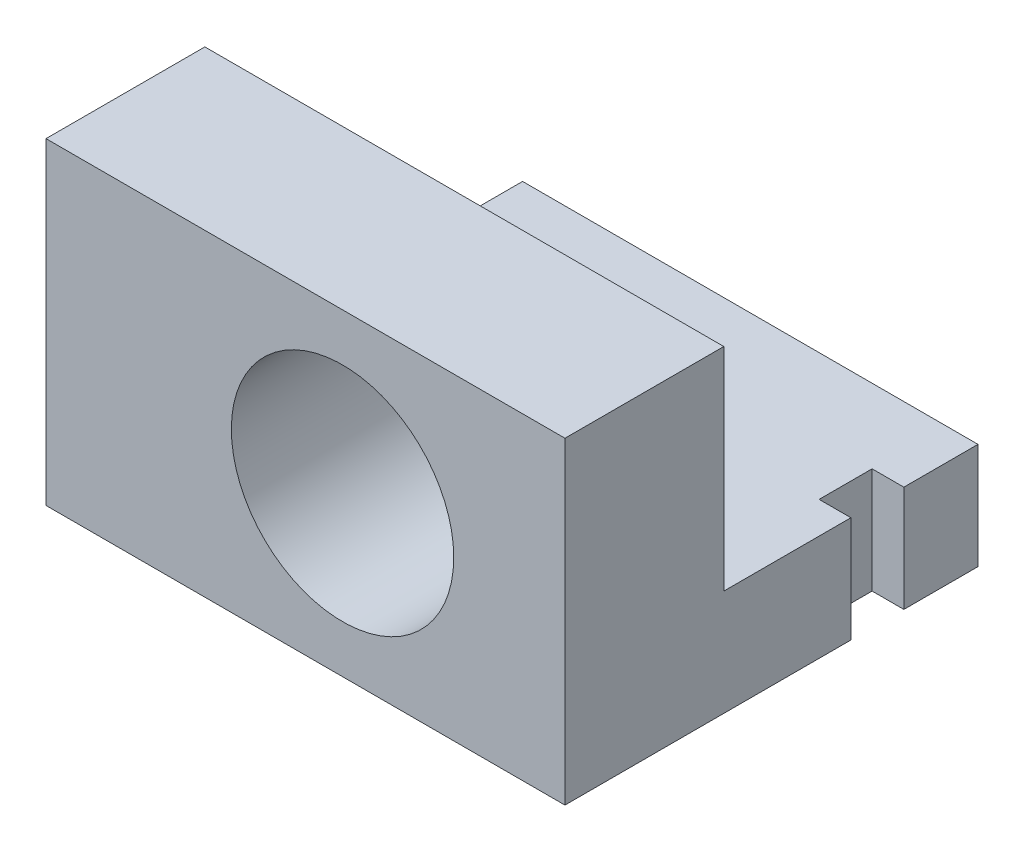
ISO-10303-21;
HEADER;
FILE_DESCRIPTION(('STEP AP214'),'2;1');
FILE_NAME('part.step','',(''),(''),'','','');
FILE_SCHEMA(('AUTOMOTIVE_DESIGN { 1 0 10303 214 1 1 1 1 }'));
ENDSEC;
DATA;
#1=APPLICATION_CONTEXT('core data for automotive mechanical design processes');
#2=APPLICATION_PROTOCOL_DEFINITION('international standard','automotive_design',2000,#1);
#3=PRODUCT_CONTEXT('',#1,'mechanical');
#4=PRODUCT('Part','Part','',(#3));
#5=PRODUCT_RELATED_PRODUCT_CATEGORY('part','',(#4));
#6=PRODUCT_DEFINITION_FORMATION('','',#4);
#7=PRODUCT_DEFINITION_CONTEXT('part definition',#1,'design');
#8=PRODUCT_DEFINITION('design','',#6,#7);
#9=PRODUCT_DEFINITION_SHAPE('','',#8);
#10=(LENGTH_UNIT() NAMED_UNIT(*) SI_UNIT(.MILLI.,.METRE.));
#11=(NAMED_UNIT(*) PLANE_ANGLE_UNIT() SI_UNIT($,.RADIAN.));
#12=(NAMED_UNIT(*) SI_UNIT($,.STERADIAN.) SOLID_ANGLE_UNIT());
#13=UNCERTAINTY_MEASURE_WITH_UNIT(LENGTH_MEASURE(1.E-05),#10,'distance_accuracy_value','');
#14=(GEOMETRIC_REPRESENTATION_CONTEXT(3) GLOBAL_UNCERTAINTY_ASSIGNED_CONTEXT((#13)) GLOBAL_UNIT_ASSIGNED_CONTEXT((#10,
#11,#12)) REPRESENTATION_CONTEXT('',''));
#15=CARTESIAN_POINT('',(0.,0.,0.));
#16=DIRECTION('',(0.,0.,1.));
#17=DIRECTION('',(1.,0.,0.));
#18=AXIS2_PLACEMENT_3D('',#15,#16,#17);
#19=CARTESIAN_POINT('',(-24.5,-15.,15.));
#20=DIRECTION('',(0.,1.,0.));
#21=DIRECTION('',(0.,0.,1.));
#22=AXIS2_PLACEMENT_3D('',#19,#20,#21);
#23=PLANE('',#22);
#24=DIRECTION('',(1.,0.,0.));
#25=VECTOR('',#24,1.);
#26=CARTESIAN_POINT('',(21.5,-15.,-17.));
#27=LINE('',#26,#25);
#28=CARTESIAN_POINT('',(21.5,-15.,-17.));
#29=VERTEX_POINT('',#28);
#30=CARTESIAN_POINT('',(24.5,-15.,-17.));
#31=VERTEX_POINT('',#30);
#32=EDGE_CURVE('E171',#29,#31,#27,.T.);
#33=ORIENTED_EDGE('',*,*,#32,.F.);
#34=DIRECTION('',(0.,0.,1.));
#35=VECTOR('',#34,1.);
#36=CARTESIAN_POINT('',(21.5,-15.,-17.));
#37=LINE('',#36,#35);
#38=CARTESIAN_POINT('',(21.5,-15.,-12.));
#39=VERTEX_POINT('',#38);
#40=EDGE_CURVE('E158',#29,#39,#37,.T.);
#41=ORIENTED_EDGE('',*,*,#40,.T.);
#42=DIRECTION('',(1.,0.,0.));
#43=VECTOR('',#42,1.);
#44=CARTESIAN_POINT('',(21.5,-15.,-12.));
#45=LINE('',#44,#43);
#46=CARTESIAN_POINT('',(24.5,-15.,-12.));
#47=VERTEX_POINT('',#46);
#48=EDGE_CURVE('E156',#39,#47,#45,.T.);
#49=ORIENTED_EDGE('',*,*,#48,.T.);
#50=DIRECTION('',(0.,0.,-1.));
#51=VECTOR('',#50,1.);
#52=CARTESIAN_POINT('',(24.5,-15.,15.));
#53=LINE('',#52,#51);
#54=CARTESIAN_POINT('',(24.5,-15.,15.));
#55=VERTEX_POINT('',#54);
#56=EDGE_CURVE('E254',#55,#47,#53,.T.);
#57=ORIENTED_EDGE('',*,*,#56,.F.);
#58=DIRECTION('',(1.,0.,0.));
#59=VECTOR('',#58,1.);
#60=CARTESIAN_POINT('',(-24.5,-15.,15.));
#61=LINE('',#60,#59);
#62=CARTESIAN_POINT('',(-24.5,-15.,15.));
#63=VERTEX_POINT('',#62);
#64=EDGE_CURVE('E233',#63,#55,#61,.T.);
#65=ORIENTED_EDGE('',*,*,#64,.F.);
#66=DIRECTION('',(0.,0.,-1.));
#67=VECTOR('',#66,1.);
#68=CARTESIAN_POINT('',(-24.5,-15.,15.));
#69=LINE('',#68,#67);
#70=CARTESIAN_POINT('',(-24.5,-15.,0.));
#71=VERTEX_POINT('',#70);
#72=EDGE_CURVE('E37',#63,#71,#69,.T.);
#73=ORIENTED_EDGE('',*,*,#72,.T.);
#74=DIRECTION('',(1.,0.,0.));
#75=VECTOR('',#74,1.);
#76=CARTESIAN_POINT('',(-24.5,-15.,0.));
#77=LINE('',#76,#75);
#78=CARTESIAN_POINT('',(-18.5,-15.,0.));
#79=VERTEX_POINT('',#78);
#80=EDGE_CURVE('E243',#71,#79,#77,.T.);
#81=ORIENTED_EDGE('',*,*,#80,.T.);
#82=DIRECTION('',(0.,0.,1.));
#83=VECTOR('',#82,1.);
#84=CARTESIAN_POINT('',(-18.5,-15.,-24.));
#85=LINE('',#84,#83);
#86=CARTESIAN_POINT('',(-18.5,-15.,-12.));
#87=VERTEX_POINT('',#86);
#88=EDGE_CURVE('E218',#87,#79,#85,.T.);
#89=ORIENTED_EDGE('',*,*,#88,.F.);
#90=DIRECTION('',(-1.,0.,0.));
#91=VECTOR('',#90,1.);
#92=CARTESIAN_POINT('',(-15.5,-15.,-12.));
#93=LINE('',#92,#91);
#94=CARTESIAN_POINT('',(-15.5,-15.,-12.));
#95=VERTEX_POINT('',#94);
#96=EDGE_CURVE('E195',#95,#87,#93,.T.);
#97=ORIENTED_EDGE('',*,*,#96,.F.);
#98=DIRECTION('',(0.,0.,1.));
#99=VECTOR('',#98,1.);
#100=CARTESIAN_POINT('',(-15.5,-15.,-17.));
#101=LINE('',#100,#99);
#102=CARTESIAN_POINT('',(-15.5,-15.,-17.));
#103=VERTEX_POINT('',#102);
#104=EDGE_CURVE('E179',#103,#95,#101,.T.);
#105=ORIENTED_EDGE('',*,*,#104,.F.);
#106=DIRECTION('',(-1.,0.,0.));
#107=VECTOR('',#106,1.);
#108=CARTESIAN_POINT('',(-15.5,-15.,-17.));
#109=LINE('',#108,#107);
#110=CARTESIAN_POINT('',(-18.5,-15.,-17.));
#111=VERTEX_POINT('',#110);
#112=EDGE_CURVE('E185',#103,#111,#109,.T.);
#113=ORIENTED_EDGE('',*,*,#112,.T.);
#114=CARTESIAN_POINT('',(-18.5,-15.,-24.));
#115=VERTEX_POINT('',#114);
#116=EDGE_CURVE('E219',#115,#111,#85,.T.);
#117=ORIENTED_EDGE('',*,*,#116,.F.);
#118=DIRECTION('',(-1.,0.,0.));
#119=VECTOR('',#118,1.);
#120=CARTESIAN_POINT('',(24.5,-15.,-24.));
#121=LINE('',#120,#119);
#122=CARTESIAN_POINT('',(24.5,-15.,-24.));
#123=VERTEX_POINT('',#122);
#124=EDGE_CURVE('E202',#123,#115,#121,.T.);
#125=ORIENTED_EDGE('',*,*,#124,.F.);
#126=EDGE_CURVE('E253',#31,#123,#53,.T.);
#127=ORIENTED_EDGE('',*,*,#126,.F.);
#128=EDGE_LOOP('',(#33,#41,#49,#57,#65,#73,#81,#89,#97,#105,#113,#117,#125,#127));
#129=FACE_BOUND('',#128,.T.);
#130=ADVANCED_FACE('F33',(#129),#23,.F.);
#131=CARTESIAN_POINT('',(24.5,15.,15.));
#132=DIRECTION('',(-1.,0.,0.));
#133=DIRECTION('',(0.,-1.,0.));
#134=AXIS2_PLACEMENT_3D('',#131,#132,#133);
#135=PLANE('',#134);
#136=DIRECTION('',(0.,-1.,0.));
#137=VECTOR('',#136,1.);
#138=CARTESIAN_POINT('',(24.5,-5.,-17.));
#139=LINE('',#138,#137);
#140=CARTESIAN_POINT('',(24.5,-5.,-17.));
#141=VERTEX_POINT('',#140);
#142=EDGE_CURVE('E266',#141,#31,#139,.T.);
#143=ORIENTED_EDGE('',*,*,#142,.T.);
#144=ORIENTED_EDGE('',*,*,#126,.T.);
#145=DIRECTION('',(0.,-1.,0.));
#146=VECTOR('',#145,1.);
#147=CARTESIAN_POINT('',(24.5,-15.,-24.));
#148=LINE('',#147,#146);
#149=CARTESIAN_POINT('',(24.5,-5.,-24.));
#150=VERTEX_POINT('',#149);
#151=EDGE_CURVE('E199',#150,#123,#148,.T.);
#152=ORIENTED_EDGE('',*,*,#151,.F.);
#153=DIRECTION('',(0.,0.,1.));
#154=VECTOR('',#153,1.);
#155=CARTESIAN_POINT('',(24.5,-5.,-24.));
#156=LINE('',#155,#154);
#157=EDGE_CURVE('E211',#150,#141,#156,.T.);
#158=ORIENTED_EDGE('',*,*,#157,.T.);
#159=EDGE_LOOP('',(#143,#144,#152,#158));
#160=FACE_BOUND('',#159,.T.);
#161=ADVANCED_FACE('F265',(#160),#135,.F.);
#162=DIRECTION('',(0.,1.,0.));
#163=VECTOR('',#162,1.);
#164=CARTESIAN_POINT('',(24.5,-5.,-12.));
#165=LINE('',#164,#163);
#166=CARTESIAN_POINT('',(24.5,-5.,-12.));
#167=VERTEX_POINT('',#166);
#168=EDGE_CURVE('E278',#47,#167,#165,.T.);
#169=ORIENTED_EDGE('',*,*,#168,.T.);
#170=CARTESIAN_POINT('',(24.5,-5.,0.));
#171=VERTEX_POINT('',#170);
#172=EDGE_CURVE('E168',#167,#171,#156,.T.);
#173=ORIENTED_EDGE('',*,*,#172,.T.);
#174=DIRECTION('',(0.,1.,0.));
#175=VECTOR('',#174,1.);
#176=CARTESIAN_POINT('',(24.5,15.,0.));
#177=LINE('',#176,#175);
#178=CARTESIAN_POINT('',(24.5,15.,0.));
#179=VERTEX_POINT('',#178);
#180=EDGE_CURVE('E246',#171,#179,#177,.T.);
#181=ORIENTED_EDGE('',*,*,#180,.T.);
#182=DIRECTION('',(0.,0.,-1.));
#183=VECTOR('',#182,1.);
#184=CARTESIAN_POINT('',(24.5,15.,15.));
#185=LINE('',#184,#183);
#186=CARTESIAN_POINT('',(24.5,15.,15.));
#187=VERTEX_POINT('',#186);
#188=EDGE_CURVE('E251',#187,#179,#185,.T.);
#189=ORIENTED_EDGE('',*,*,#188,.F.);
#190=DIRECTION('',(0.,1.,0.));
#191=VECTOR('',#190,1.);
#192=CARTESIAN_POINT('',(24.5,15.,15.));
#193=LINE('',#192,#191);
#194=EDGE_CURVE('E236',#55,#187,#193,.T.);
#195=ORIENTED_EDGE('',*,*,#194,.F.);
#196=ORIENTED_EDGE('',*,*,#56,.T.);
#197=EDGE_LOOP('',(#169,#173,#181,#189,#195,#196));
#198=FACE_BOUND('',#197,.T.);
#199=ADVANCED_FACE('F284',(#198),#135,.F.);
#200=CARTESIAN_POINT('',(24.5,-5.,-24.));
#201=DIRECTION('',(0.,-1.,0.));
#202=DIRECTION('',(0.,0.,-1.));
#203=AXIS2_PLACEMENT_3D('',#200,#201,#202);
#204=PLANE('',#203);
#205=DIRECTION('',(1.,0.,0.));
#206=VECTOR('',#205,1.);
#207=CARTESIAN_POINT('',(21.5,-5.,-17.));
#208=LINE('',#207,#206);
#209=CARTESIAN_POINT('',(21.5,-5.,-17.));
#210=VERTEX_POINT('',#209);
#211=EDGE_CURVE('E169',#210,#141,#208,.T.);
#212=ORIENTED_EDGE('',*,*,#211,.T.);
#213=ORIENTED_EDGE('',*,*,#157,.F.);
#214=DIRECTION('',(1.,0.,0.));
#215=VECTOR('',#214,1.);
#216=CARTESIAN_POINT('',(24.5,-5.,-24.));
#217=LINE('',#216,#215);
#218=CARTESIAN_POINT('',(-18.5,-5.,-24.));
#219=VERTEX_POINT('',#218);
#220=EDGE_CURVE('E206',#219,#150,#217,.T.);
#221=ORIENTED_EDGE('',*,*,#220,.F.);
#222=DIRECTION('',(0.,0.,1.));
#223=VECTOR('',#222,1.);
#224=CARTESIAN_POINT('',(-18.5,-5.,-24.));
#225=LINE('',#224,#223);
#226=CARTESIAN_POINT('',(-18.5,-5.,-17.));
#227=VERTEX_POINT('',#226);
#228=EDGE_CURVE('E215',#219,#227,#225,.T.);
#229=ORIENTED_EDGE('',*,*,#228,.T.);
#230=DIRECTION('',(-1.,0.,0.));
#231=VECTOR('',#230,1.);
#232=CARTESIAN_POINT('',(-15.5,-5.,-17.));
#233=LINE('',#232,#231);
#234=CARTESIAN_POINT('',(-15.5,-5.,-17.));
#235=VERTEX_POINT('',#234);
#236=EDGE_CURVE('E189',#235,#227,#233,.T.);
#237=ORIENTED_EDGE('',*,*,#236,.F.);
#238=DIRECTION('',(0.,0.,-1.));
#239=VECTOR('',#238,1.);
#240=CARTESIAN_POINT('',(-15.5,-5.,-17.));
#241=LINE('',#240,#239);
#242=CARTESIAN_POINT('',(-15.5,-5.,-12.));
#243=VERTEX_POINT('',#242);
#244=EDGE_CURVE('E183',#243,#235,#241,.T.);
#245=ORIENTED_EDGE('',*,*,#244,.F.);
#246=DIRECTION('',(-1.,0.,0.));
#247=VECTOR('',#246,1.);
#248=CARTESIAN_POINT('',(-15.5,-5.,-12.));
#249=LINE('',#248,#247);
#250=CARTESIAN_POINT('',(-18.5,-5.,-12.));
#251=VERTEX_POINT('',#250);
#252=EDGE_CURVE('E192',#243,#251,#249,.T.);
#253=ORIENTED_EDGE('',*,*,#252,.T.);
#254=CARTESIAN_POINT('',(-18.5,-5.,0.));
#255=VERTEX_POINT('',#254);
#256=EDGE_CURVE('E214',#251,#255,#225,.T.);
#257=ORIENTED_EDGE('',*,*,#256,.T.);
#258=DIRECTION('',(1.,0.,0.));
#259=VECTOR('',#258,1.);
#260=CARTESIAN_POINT('',(24.5,-5.,0.));
#261=LINE('',#260,#259);
#262=CARTESIAN_POINT('',(-5.73309265630969,-5.,0.));
#263=VERTEX_POINT('',#262);
#264=EDGE_CURVE('E43',#255,#263,#261,.T.);
#265=ORIENTED_EDGE('',*,*,#264,.T.);
#266=CARTESIAN_POINT('',(12.7330926563097,-5.,0.));
#267=VERTEX_POINT('',#266);
#268=EDGE_CURVE('E44',#263,#267,#261,.T.);
#269=ORIENTED_EDGE('',*,*,#268,.T.);
#270=EDGE_CURVE('E11',#267,#171,#261,.T.);
#271=ORIENTED_EDGE('',*,*,#270,.T.);
#272=ORIENTED_EDGE('',*,*,#172,.F.);
#273=DIRECTION('',(1.,0.,0.));
#274=VECTOR('',#273,1.);
#275=CARTESIAN_POINT('',(21.5,-5.,-12.));
#276=LINE('',#275,#274);
#277=CARTESIAN_POINT('',(21.5,-5.,-12.));
#278=VERTEX_POINT('',#277);
#279=EDGE_CURVE('E153',#278,#167,#276,.T.);
#280=ORIENTED_EDGE('',*,*,#279,.F.);
#281=DIRECTION('',(0.,0.,-1.));
#282=VECTOR('',#281,1.);
#283=CARTESIAN_POINT('',(21.5,-5.,-17.));
#284=LINE('',#283,#282);
#285=EDGE_CURVE('E159',#278,#210,#284,.T.);
#286=ORIENTED_EDGE('',*,*,#285,.T.);
#287=EDGE_LOOP('',(#212,#213,#221,#229,#237,#245,#253,#257,#265,#269,#271,#272,#280,#286));
#288=FACE_BOUND('',#287,.T.);
#289=ADVANCED_FACE('F167',(#288),#204,.F.);
#290=CARTESIAN_POINT('',(-18.5,-15.,-24.));
#291=DIRECTION('',(1.,0.,0.));
#292=DIRECTION('',(0.,0.,-1.));
#293=AXIS2_PLACEMENT_3D('',#290,#291,#292);
#294=PLANE('',#293);
#295=ORIENTED_EDGE('',*,*,#116,.T.);
#296=DIRECTION('',(0.,-1.,0.));
#297=VECTOR('',#296,1.);
#298=CARTESIAN_POINT('',(-18.5,-5.,-17.));
#299=LINE('',#298,#297);
#300=EDGE_CURVE('E186',#227,#111,#299,.T.);
#301=ORIENTED_EDGE('',*,*,#300,.F.);
#302=ORIENTED_EDGE('',*,*,#228,.F.);
#303=DIRECTION('',(0.,1.,0.));
#304=VECTOR('',#303,1.);
#305=CARTESIAN_POINT('',(-18.5,-15.,-24.));
#306=LINE('',#305,#304);
#307=EDGE_CURVE('E204',#115,#219,#306,.T.);
#308=ORIENTED_EDGE('',*,*,#307,.F.);
#309=EDGE_LOOP('',(#295,#301,#302,#308));
#310=FACE_BOUND('',#309,.T.);
#311=ADVANCED_FACE('F313',(#310),#294,.F.);
#312=CARTESIAN_POINT('',(0.,0.,0.));
#313=DIRECTION('',(0.,0.,1.));
#314=DIRECTION('',(1.,0.,0.));
#315=AXIS2_PLACEMENT_3D('',#312,#313,#314);
#316=PLANE('',#315);
#317=ORIENTED_EDGE('',*,*,#270,.F.);
#318=CARTESIAN_POINT('',(3.5,0.,0.));
#319=DIRECTION('',(0.,0.,-1.));
#320=DIRECTION('',(-1.,0.,0.));
#321=AXIS2_PLACEMENT_3D('',#318,#319,#320);
#322=CIRCLE('',#321,10.5);
#323=EDGE_CURVE('E222',#263,#267,#322,.T.);
#324=ORIENTED_EDGE('',*,*,#323,.F.);
#325=ORIENTED_EDGE('',*,*,#264,.F.);
#326=DIRECTION('',(0.,1.,0.));
#327=VECTOR('',#326,1.);
#328=CARTESIAN_POINT('',(-18.5,-15.,0.));
#329=LINE('',#328,#327);
#330=EDGE_CURVE('E191',#79,#255,#329,.T.);
#331=ORIENTED_EDGE('',*,*,#330,.F.);
#332=ORIENTED_EDGE('',*,*,#80,.F.);
#333=DIRECTION('',(0.,-1.,0.));
#334=VECTOR('',#333,1.);
#335=CARTESIAN_POINT('',(-24.5,15.,0.));
#336=LINE('',#335,#334);
#337=CARTESIAN_POINT('',(-24.5,15.,0.));
#338=VERTEX_POINT('',#337);
#339=EDGE_CURVE('E229',#338,#71,#336,.T.);
#340=ORIENTED_EDGE('',*,*,#339,.F.);
#341=DIRECTION('',(-1.,0.,0.));
#342=VECTOR('',#341,1.);
#343=CARTESIAN_POINT('',(-24.5,15.,0.));
#344=LINE('',#343,#342);
#345=EDGE_CURVE('E234',#179,#338,#344,.T.);
#346=ORIENTED_EDGE('',*,*,#345,.F.);
#347=ORIENTED_EDGE('',*,*,#180,.F.);
#348=EDGE_LOOP('',(#317,#324,#325,#331,#332,#340,#346,#347));
#349=FACE_BOUND('',#348,.T.);
#350=ADVANCED_FACE('F297',(#349),#316,.F.);
#351=CARTESIAN_POINT('',(-24.5,15.,15.));
#352=DIRECTION('',(1.,0.,0.));
#353=DIRECTION('',(0.,0.,-1.));
#354=AXIS2_PLACEMENT_3D('',#351,#352,#353);
#355=PLANE('',#354);
#356=ORIENTED_EDGE('',*,*,#339,.T.);
#357=ORIENTED_EDGE('',*,*,#72,.F.);
#358=DIRECTION('',(0.,-1.,0.));
#359=VECTOR('',#358,1.);
#360=CARTESIAN_POINT('',(-24.5,15.,15.));
#361=LINE('',#360,#359);
#362=CARTESIAN_POINT('',(-24.5,15.,15.));
#363=VERTEX_POINT('',#362);
#364=EDGE_CURVE('E230',#363,#63,#361,.T.);
#365=ORIENTED_EDGE('',*,*,#364,.F.);
#366=DIRECTION('',(0.,0.,-1.));
#367=VECTOR('',#366,1.);
#368=CARTESIAN_POINT('',(-24.5,15.,15.));
#369=LINE('',#368,#367);
#370=EDGE_CURVE('E240',#363,#338,#369,.T.);
#371=ORIENTED_EDGE('',*,*,#370,.T.);
#372=EDGE_LOOP('',(#356,#357,#365,#371));
#373=FACE_BOUND('',#372,.T.);
#374=ADVANCED_FACE('F35',(#373),#355,.F.);
#375=CARTESIAN_POINT('',(-24.5,15.,15.));
#376=DIRECTION('',(0.,-1.,0.));
#377=DIRECTION('',(1.,0.,0.));
#378=AXIS2_PLACEMENT_3D('',#375,#376,#377);
#379=PLANE('',#378);
#380=ORIENTED_EDGE('',*,*,#345,.T.);
#381=ORIENTED_EDGE('',*,*,#370,.F.);
#382=DIRECTION('',(-1.,0.,0.));
#383=VECTOR('',#382,1.);
#384=CARTESIAN_POINT('',(-24.5,15.,15.));
#385=LINE('',#384,#383);
#386=EDGE_CURVE('E238',#187,#363,#385,.T.);
#387=ORIENTED_EDGE('',*,*,#386,.F.);
#388=ORIENTED_EDGE('',*,*,#188,.T.);
#389=EDGE_LOOP('',(#380,#381,#387,#388));
#390=FACE_BOUND('',#389,.T.);
#391=ADVANCED_FACE('F329',(#390),#379,.F.);
#392=CARTESIAN_POINT('',(0.,0.,15.));
#393=DIRECTION('',(0.,0.,1.));
#394=DIRECTION('',(1.,0.,0.));
#395=AXIS2_PLACEMENT_3D('',#392,#393,#394);
#396=PLANE('',#395);
#397=CARTESIAN_POINT('',(3.5,0.,15.));
#398=DIRECTION('',(0.,0.,1.));
#399=DIRECTION('',(1.,0.,0.));
#400=AXIS2_PLACEMENT_3D('',#397,#398,#399);
#401=CIRCLE('',#400,10.5);
#402=CARTESIAN_POINT('',(14.,0.,15.));
#403=VERTEX_POINT('',#402);
#404=EDGE_CURVE('E226',#403,#403,#401,.T.);
#405=ORIENTED_EDGE('',*,*,#404,.F.);
#406=EDGE_LOOP('',(#405));
#407=FACE_BOUND('',#406,.T.);
#408=ORIENTED_EDGE('',*,*,#364,.T.);
#409=ORIENTED_EDGE('',*,*,#64,.T.);
#410=ORIENTED_EDGE('',*,*,#194,.T.);
#411=ORIENTED_EDGE('',*,*,#386,.T.);
#412=EDGE_LOOP('',(#408,#409,#410,#411));
#413=FACE_BOUND('',#412,.T.);
#414=ADVANCED_FACE('F287',(#407,#413),#396,.T.);
#415=CARTESIAN_POINT('',(3.5,0.,23.));
#416=DIRECTION('',(0.,0.,-1.));
#417=DIRECTION('',(-1.,0.,0.));
#418=AXIS2_PLACEMENT_3D('',#415,#416,#417);
#419=CYLINDRICAL_SURFACE('',#418,10.5);
#420=ORIENTED_EDGE('',*,*,#404,.T.);
#421=EDGE_LOOP('',(#420));
#422=FACE_BOUND('',#421,.T.);
#423=EDGE_CURVE('E223',#267,#263,#322,.T.);
#424=ORIENTED_EDGE('',*,*,#423,.T.);
#425=ORIENTED_EDGE('',*,*,#323,.T.);
#426=EDGE_LOOP('',(#424,#425));
#427=FACE_BOUND('',#426,.T.);
#428=ADVANCED_FACE('F337',(#422,#427),#419,.F.);
#429=CARTESIAN_POINT('',(0.,0.,0.));
#430=DIRECTION('',(0.,0.,1.));
#431=DIRECTION('',(1.,0.,0.));
#432=AXIS2_PLACEMENT_3D('',#429,#430,#431);
#433=PLANE('',#432);
#434=ORIENTED_EDGE('',*,*,#423,.F.);
#435=ORIENTED_EDGE('',*,*,#268,.F.);
#436=EDGE_LOOP('',(#434,#435));
#437=FACE_BOUND('',#436,.T.);
#438=ADVANCED_FACE('F341',(#437),#433,.T.);
#439=ORIENTED_EDGE('',*,*,#256,.F.);
#440=DIRECTION('',(0.,1.,0.));
#441=VECTOR('',#440,1.);
#442=CARTESIAN_POINT('',(-18.5,-5.,-12.));
#443=LINE('',#442,#441);
#444=EDGE_CURVE('E180',#87,#251,#443,.T.);
#445=ORIENTED_EDGE('',*,*,#444,.F.);
#446=ORIENTED_EDGE('',*,*,#88,.T.);
#447=ORIENTED_EDGE('',*,*,#330,.T.);
#448=EDGE_LOOP('',(#439,#445,#446,#447));
#449=FACE_BOUND('',#448,.T.);
#450=ADVANCED_FACE('F302',(#449),#294,.F.);
#451=CARTESIAN_POINT('',(0.,0.,-24.));
#452=DIRECTION('',(0.,0.,1.));
#453=DIRECTION('',(1.,0.,0.));
#454=AXIS2_PLACEMENT_3D('',#451,#452,#453);
#455=PLANE('',#454);
#456=ORIENTED_EDGE('',*,*,#151,.T.);
#457=ORIENTED_EDGE('',*,*,#124,.T.);
#458=ORIENTED_EDGE('',*,*,#307,.T.);
#459=ORIENTED_EDGE('',*,*,#220,.T.);
#460=EDGE_LOOP('',(#456,#457,#458,#459));
#461=FACE_BOUND('',#460,.T.);
#462=ADVANCED_FACE('F272',(#461),#455,.F.);
#463=CARTESIAN_POINT('',(-15.5,-5.,-17.));
#464=DIRECTION('',(0.,0.,-1.));
#465=DIRECTION('',(-1.,0.,0.));
#466=AXIS2_PLACEMENT_3D('',#463,#464,#465);
#467=PLANE('',#466);
#468=ORIENTED_EDGE('',*,*,#300,.T.);
#469=ORIENTED_EDGE('',*,*,#112,.F.);
#470=DIRECTION('',(0.,-1.,0.));
#471=VECTOR('',#470,1.);
#472=CARTESIAN_POINT('',(-15.5,-5.,-17.));
#473=LINE('',#472,#471);
#474=EDGE_CURVE('E176',#235,#103,#473,.T.);
#475=ORIENTED_EDGE('',*,*,#474,.F.);
#476=ORIENTED_EDGE('',*,*,#236,.T.);
#477=EDGE_LOOP('',(#468,#469,#475,#476));
#478=FACE_BOUND('',#477,.T.);
#479=ADVANCED_FACE('F314',(#478),#467,.F.);
#480=CARTESIAN_POINT('',(-15.5,-5.,-12.));
#481=DIRECTION('',(0.,0.,1.));
#482=DIRECTION('',(1.,0.,0.));
#483=AXIS2_PLACEMENT_3D('',#480,#481,#482);
#484=PLANE('',#483);
#485=ORIENTED_EDGE('',*,*,#444,.T.);
#486=ORIENTED_EDGE('',*,*,#252,.F.);
#487=DIRECTION('',(0.,1.,0.));
#488=VECTOR('',#487,1.);
#489=CARTESIAN_POINT('',(-15.5,-5.,-12.));
#490=LINE('',#489,#488);
#491=EDGE_CURVE('E59',#95,#243,#490,.T.);
#492=ORIENTED_EDGE('',*,*,#491,.F.);
#493=ORIENTED_EDGE('',*,*,#96,.T.);
#494=EDGE_LOOP('',(#485,#486,#492,#493));
#495=FACE_BOUND('',#494,.T.);
#496=ADVANCED_FACE('F305',(#495),#484,.F.);
#497=CARTESIAN_POINT('',(-15.5,0.,0.));
#498=DIRECTION('',(-1.,0.,0.));
#499=DIRECTION('',(0.,0.,1.));
#500=AXIS2_PLACEMENT_3D('',#497,#498,#499);
#501=PLANE('',#500);
#502=ORIENTED_EDGE('',*,*,#474,.T.);
#503=ORIENTED_EDGE('',*,*,#104,.T.);
#504=ORIENTED_EDGE('',*,*,#491,.T.);
#505=ORIENTED_EDGE('',*,*,#244,.T.);
#506=EDGE_LOOP('',(#502,#503,#504,#505));
#507=FACE_BOUND('',#506,.T.);
#508=ADVANCED_FACE('F308',(#507),#501,.T.);
#509=CARTESIAN_POINT('',(21.5,-5.,-17.));
#510=DIRECTION('',(0.,0.,1.));
#511=DIRECTION('',(1.,0.,0.));
#512=AXIS2_PLACEMENT_3D('',#509,#510,#511);
#513=PLANE('',#512);
#514=ORIENTED_EDGE('',*,*,#142,.F.);
#515=ORIENTED_EDGE('',*,*,#211,.F.);
#516=DIRECTION('',(0.,-1.,0.));
#517=VECTOR('',#516,1.);
#518=CARTESIAN_POINT('',(21.5,-5.,-17.));
#519=LINE('',#518,#517);
#520=EDGE_CURVE('E51',#210,#29,#519,.T.);
#521=ORIENTED_EDGE('',*,*,#520,.T.);
#522=ORIENTED_EDGE('',*,*,#32,.T.);
#523=EDGE_LOOP('',(#514,#515,#521,#522));
#524=FACE_BOUND('',#523,.T.);
#525=ADVANCED_FACE('F277',(#524),#513,.T.);
#526=CARTESIAN_POINT('',(21.5,-5.,-12.));
#527=DIRECTION('',(0.,0.,-1.));
#528=DIRECTION('',(-1.,0.,0.));
#529=AXIS2_PLACEMENT_3D('',#526,#527,#528);
#530=PLANE('',#529);
#531=ORIENTED_EDGE('',*,*,#168,.F.);
#532=ORIENTED_EDGE('',*,*,#48,.F.);
#533=DIRECTION('',(0.,1.,0.));
#534=VECTOR('',#533,1.);
#535=CARTESIAN_POINT('',(21.5,-5.,-12.));
#536=LINE('',#535,#534);
#537=EDGE_CURVE('E150',#39,#278,#536,.T.);
#538=ORIENTED_EDGE('',*,*,#537,.T.);
#539=ORIENTED_EDGE('',*,*,#279,.T.);
#540=EDGE_LOOP('',(#531,#532,#538,#539));
#541=FACE_BOUND('',#540,.T.);
#542=ADVANCED_FACE('F151',(#541),#530,.T.);
#543=CARTESIAN_POINT('',(21.5,0.,0.));
#544=DIRECTION('',(1.,0.,0.));
#545=DIRECTION('',(0.,0.,1.));
#546=AXIS2_PLACEMENT_3D('',#543,#544,#545);
#547=PLANE('',#546);
#548=ORIENTED_EDGE('',*,*,#520,.F.);
#549=ORIENTED_EDGE('',*,*,#285,.F.);
#550=ORIENTED_EDGE('',*,*,#537,.F.);
#551=ORIENTED_EDGE('',*,*,#40,.F.);
#552=EDGE_LOOP('',(#548,#549,#550,#551));
#553=FACE_BOUND('',#552,.T.);
#554=ADVANCED_FACE('F162',(#553),#547,.T.);
#555=CLOSED_SHELL('',(#130,#161,#199,#289,#311,#350,#374,#391,#414,#428,#438,#450,#462,#479,
#496,#508,#525,#542,#554));
#556=MANIFOLD_SOLID_BREP('B2',#555);
#557=ADVANCED_BREP_SHAPE_REPRESENTATION('',(#18,#556),#14);
#558=SHAPE_DEFINITION_REPRESENTATION(#9,#557);
ENDSEC;
END-ISO-10303-21;
